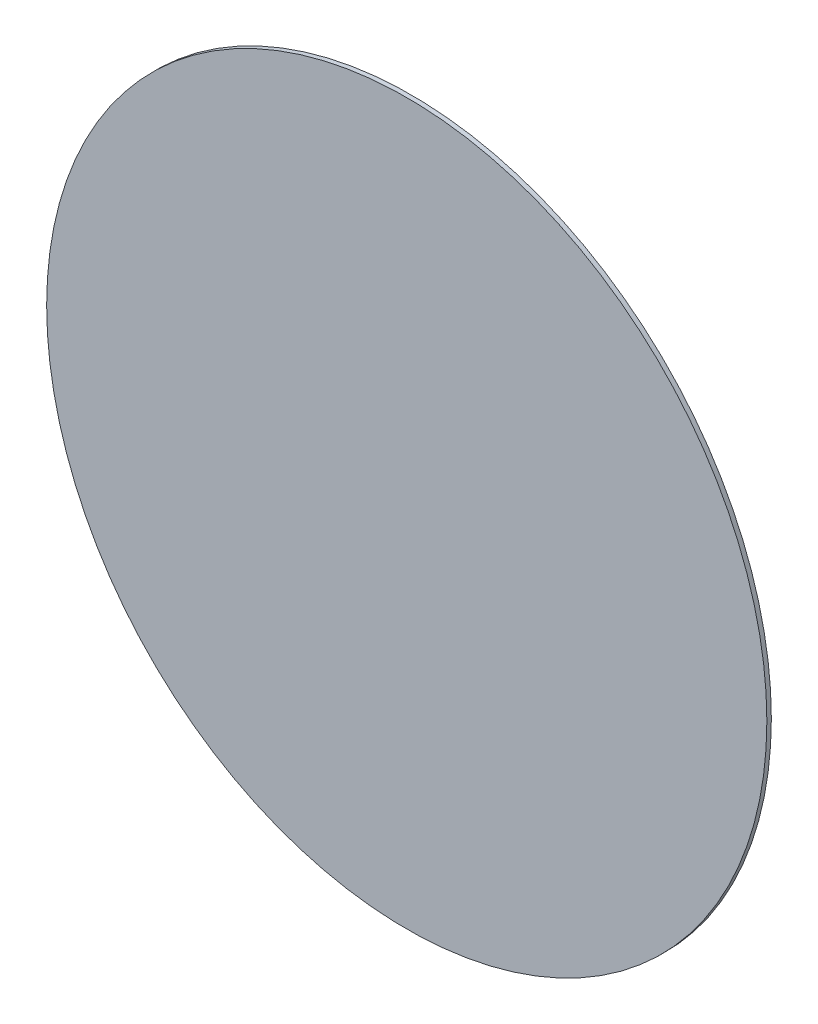
ISO-10303-21;
HEADER;
FILE_DESCRIPTION(('STEP AP214'),'2;1');
FILE_NAME('part.step','',(''),(''),'','','');
FILE_SCHEMA(('AUTOMOTIVE_DESIGN { 1 0 10303 214 1 1 1 1 }'));
ENDSEC;
DATA;
#1=APPLICATION_CONTEXT('core data for automotive mechanical design processes');
#2=APPLICATION_PROTOCOL_DEFINITION('international standard','automotive_design',2000,#1);
#3=PRODUCT_CONTEXT('',#1,'mechanical');
#4=PRODUCT('Part','Part','',(#3));
#5=PRODUCT_RELATED_PRODUCT_CATEGORY('part','',(#4));
#6=PRODUCT_DEFINITION_FORMATION('','',#4);
#7=PRODUCT_DEFINITION_CONTEXT('part definition',#1,'design');
#8=PRODUCT_DEFINITION('design','',#6,#7);
#9=PRODUCT_DEFINITION_SHAPE('','',#8);
#10=(LENGTH_UNIT() NAMED_UNIT(*) SI_UNIT(.MILLI.,.METRE.));
#11=(NAMED_UNIT(*) PLANE_ANGLE_UNIT() SI_UNIT($,.RADIAN.));
#12=(NAMED_UNIT(*) SI_UNIT($,.STERADIAN.) SOLID_ANGLE_UNIT());
#13=UNCERTAINTY_MEASURE_WITH_UNIT(LENGTH_MEASURE(1.E-05),#10,'distance_accuracy_value','');
#14=(GEOMETRIC_REPRESENTATION_CONTEXT(3) GLOBAL_UNCERTAINTY_ASSIGNED_CONTEXT((#13)) GLOBAL_UNIT_ASSIGNED_CONTEXT((#10,
#11,#12)) REPRESENTATION_CONTEXT('',''));
#15=CARTESIAN_POINT('',(0.,0.,0.));
#16=DIRECTION('',(0.,0.,1.));
#17=DIRECTION('',(1.,0.,0.));
#18=AXIS2_PLACEMENT_3D('',#15,#16,#17);
#19=CARTESIAN_POINT('',(-33142.7873673455,-18960.9498358154,38941.7001960568));
#20=DIRECTION('',(0.,0.,-1.));
#21=DIRECTION('',(-1.,0.,0.));
#22=AXIS2_PLACEMENT_3D('',#19,#20,#21);
#23=CYLINDRICAL_SURFACE('',#22,801.383310628515);
#24=CARTESIAN_POINT('',(-33142.7873673455,-18960.9498358154,38941.7001960568));
#25=DIRECTION('',(0.,0.,1.));
#26=DIRECTION('',(1.,0.,0.));
#27=AXIS2_PLACEMENT_3D('',#24,#25,#26);
#28=CIRCLE('',#27,801.383310628515);
#29=CARTESIAN_POINT('',(-32341.404056717,-18960.9498358154,38941.7001960568));
#30=VERTEX_POINT('',#29);
#31=EDGE_CURVE('E10',#30,#30,#28,.T.);
#32=ORIENTED_EDGE('',*,*,#31,.F.);
#33=EDGE_LOOP('',(#32));
#34=FACE_BOUND('',#33,.T.);
#35=CARTESIAN_POINT('',(-33142.7873673455,-18960.9498358154,38931.7001960568));
#36=DIRECTION('',(0.,0.,1.));
#37=DIRECTION('',(1.,0.,0.));
#38=AXIS2_PLACEMENT_3D('',#35,#36,#37);
#39=CIRCLE('',#38,801.383310628515);
#40=CARTESIAN_POINT('',(-32341.404056717,-18960.9498358154,38931.7001960568));
#41=VERTEX_POINT('',#40);
#42=EDGE_CURVE('E38',#41,#41,#39,.T.);
#43=ORIENTED_EDGE('',*,*,#42,.T.);
#44=EDGE_LOOP('',(#43));
#45=FACE_BOUND('',#44,.T.);
#46=ADVANCED_FACE('F35',(#34,#45),#23,.T.);
#47=CARTESIAN_POINT('',(-33142.7873673455,-18960.9498358154,38941.7001960568));
#48=DIRECTION('',(0.,0.,1.));
#49=DIRECTION('',(1.,0.,0.));
#50=AXIS2_PLACEMENT_3D('',#47,#48,#49);
#51=PLANE('',#50);
#52=ORIENTED_EDGE('',*,*,#31,.T.);
#53=EDGE_LOOP('',(#52));
#54=FACE_BOUND('',#53,.T.);
#55=ADVANCED_FACE('F50',(#54),#51,.T.);
#56=CARTESIAN_POINT('',(-33142.7873673455,-18960.9498358154,38931.7001960568));
#57=DIRECTION('',(0.,0.,1.));
#58=DIRECTION('',(1.,0.,0.));
#59=AXIS2_PLACEMENT_3D('',#56,#57,#58);
#60=PLANE('',#59);
#61=ORIENTED_EDGE('',*,*,#42,.F.);
#62=EDGE_LOOP('',(#61));
#63=FACE_BOUND('',#62,.T.);
#64=ADVANCED_FACE('F48',(#63),#60,.F.);
#65=CLOSED_SHELL('',(#46,#55,#64));
#66=MANIFOLD_SOLID_BREP('B2',#65);
#67=ADVANCED_BREP_SHAPE_REPRESENTATION('',(#18,#66),#14);
#68=SHAPE_DEFINITION_REPRESENTATION(#9,#67);
ENDSEC;
END-ISO-10303-21;
